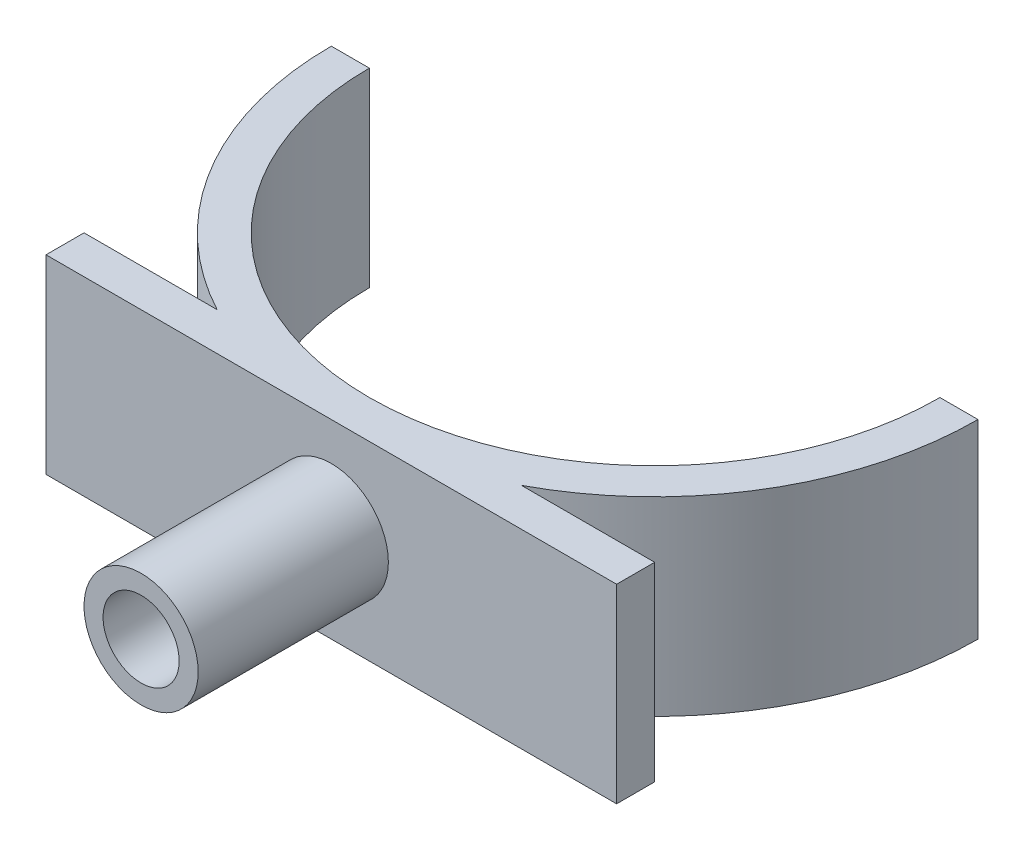
ISO-10303-21;
HEADER;
FILE_DESCRIPTION(('STEP AP214'),'2;1');
FILE_NAME('part.step','',(''),(''),'','','');
FILE_SCHEMA(('AUTOMOTIVE_DESIGN { 1 0 10303 214 1 1 1 1 }'));
ENDSEC;
DATA;
#1=APPLICATION_CONTEXT('core data for automotive mechanical design processes');
#2=APPLICATION_PROTOCOL_DEFINITION('international standard','automotive_design',2000,#1);
#3=PRODUCT_CONTEXT('',#1,'mechanical');
#4=PRODUCT('Part','Part','',(#3));
#5=PRODUCT_RELATED_PRODUCT_CATEGORY('part','',(#4));
#6=PRODUCT_DEFINITION_FORMATION('','',#4);
#7=PRODUCT_DEFINITION_CONTEXT('part definition',#1,'design');
#8=PRODUCT_DEFINITION('design','',#6,#7);
#9=PRODUCT_DEFINITION_SHAPE('','',#8);
#10=(LENGTH_UNIT() NAMED_UNIT(*) SI_UNIT(.MILLI.,.METRE.));
#11=(NAMED_UNIT(*) PLANE_ANGLE_UNIT() SI_UNIT($,.RADIAN.));
#12=(NAMED_UNIT(*) SI_UNIT($,.STERADIAN.) SOLID_ANGLE_UNIT());
#13=UNCERTAINTY_MEASURE_WITH_UNIT(LENGTH_MEASURE(1.E-05),#10,'distance_accuracy_value','');
#14=(GEOMETRIC_REPRESENTATION_CONTEXT(3) GLOBAL_UNCERTAINTY_ASSIGNED_CONTEXT((#13)) GLOBAL_UNIT_ASSIGNED_CONTEXT((#10,
#11,#12)) REPRESENTATION_CONTEXT('',''));
#15=CARTESIAN_POINT('',(0.,0.,0.));
#16=DIRECTION('',(0.,0.,1.));
#17=DIRECTION('',(1.,0.,0.));
#18=AXIS2_PLACEMENT_3D('',#15,#16,#17);
#19=CARTESIAN_POINT('',(0.,0.,-2.));
#20=DIRECTION('',(0.,0.,-1.));
#21=DIRECTION('',(-1.,0.,0.));
#22=AXIS2_PLACEMENT_3D('',#19,#20,#21);
#23=PLANE('',#22);
#24=DIRECTION('',(-1.,0.,0.));
#25=VECTOR('',#24,1.);
#26=CARTESIAN_POINT('',(15.,-5.,-2.));
#27=LINE('',#26,#25);
#28=CARTESIAN_POINT('',(15.,-5.,-2.));
#29=VERTEX_POINT('',#28);
#30=CARTESIAN_POINT('',(8.,-5.,-2.));
#31=VERTEX_POINT('',#30);
#32=EDGE_CURVE('E101',#29,#31,#27,.T.);
#33=ORIENTED_EDGE('',*,*,#32,.T.);
#34=DIRECTION('',(0.,-1.,0.));
#35=VECTOR('',#34,1.);
#36=CARTESIAN_POINT('',(8.,5.,-2.));
#37=LINE('',#36,#35);
#38=CARTESIAN_POINT('',(8.,5.,-2.));
#39=VERTEX_POINT('',#38);
#40=EDGE_CURVE('E105',#39,#31,#37,.T.);
#41=ORIENTED_EDGE('',*,*,#40,.F.);
#42=DIRECTION('',(1.,0.,0.));
#43=VECTOR('',#42,1.);
#44=CARTESIAN_POINT('',(0.,5.,-2.));
#45=LINE('',#44,#43);
#46=CARTESIAN_POINT('',(15.,5.,-2.));
#47=VERTEX_POINT('',#46);
#48=EDGE_CURVE('E215',#39,#47,#45,.T.);
#49=ORIENTED_EDGE('',*,*,#48,.T.);
#50=DIRECTION('',(0.,-1.,0.));
#51=VECTOR('',#50,1.);
#52=CARTESIAN_POINT('',(15.,5.,-2.));
#53=LINE('',#52,#51);
#54=EDGE_CURVE('E214',#47,#29,#53,.T.);
#55=ORIENTED_EDGE('',*,*,#54,.T.);
#56=EDGE_LOOP('',(#33,#41,#49,#55));
#57=FACE_BOUND('',#56,.T.);
#58=ADVANCED_FACE('F85',(#57),#23,.T.);
#59=CARTESIAN_POINT('',(0.,0.,10.));
#60=DIRECTION('',(0.,0.,1.));
#61=DIRECTION('',(1.,0.,0.));
#62=AXIS2_PLACEMENT_3D('',#59,#60,#61);
#63=PLANE('',#62);
#64=CARTESIAN_POINT('',(0.,0.,10.));
#65=DIRECTION('',(0.,0.,1.));
#66=DIRECTION('',(1.,0.,0.));
#67=AXIS2_PLACEMENT_3D('',#64,#65,#66);
#68=CIRCLE('',#67,3.);
#69=CARTESIAN_POINT('',(3.,0.,10.));
#70=VERTEX_POINT('',#69);
#71=EDGE_CURVE('E12',#70,#70,#68,.T.);
#72=ORIENTED_EDGE('',*,*,#71,.T.);
#73=EDGE_LOOP('',(#72));
#74=FACE_BOUND('',#73,.T.);
#75=CARTESIAN_POINT('',(0.,0.,10.));
#76=DIRECTION('',(0.,0.,1.));
#77=DIRECTION('',(1.,0.,0.));
#78=AXIS2_PLACEMENT_3D('',#75,#76,#77);
#79=CIRCLE('',#78,2.);
#80=CARTESIAN_POINT('',(2.,0.,10.));
#81=VERTEX_POINT('',#80);
#82=EDGE_CURVE('E94',#81,#81,#79,.T.);
#83=ORIENTED_EDGE('',*,*,#82,.F.);
#84=EDGE_LOOP('',(#83));
#85=FACE_BOUND('',#84,.T.);
#86=ADVANCED_FACE('F297',(#74,#85),#63,.T.);
#87=CARTESIAN_POINT('',(0.,0.,10.));
#88=DIRECTION('',(0.,0.,-1.));
#89=DIRECTION('',(-1.,0.,0.));
#90=AXIS2_PLACEMENT_3D('',#87,#88,#89);
#91=CYLINDRICAL_SURFACE('',#90,3.);
#92=ORIENTED_EDGE('',*,*,#71,.F.);
#93=EDGE_LOOP('',(#92));
#94=FACE_BOUND('',#93,.T.);
#95=CARTESIAN_POINT('',(0.,0.,0.));
#96=DIRECTION('',(0.,0.,1.));
#97=DIRECTION('',(1.,0.,0.));
#98=AXIS2_PLACEMENT_3D('',#95,#96,#97);
#99=CIRCLE('',#98,3.);
#100=CARTESIAN_POINT('',(3.,0.,0.));
#101=VERTEX_POINT('',#100);
#102=EDGE_CURVE('E89',#101,#101,#99,.T.);
#103=ORIENTED_EDGE('',*,*,#102,.T.);
#104=EDGE_LOOP('',(#103));
#105=FACE_BOUND('',#104,.T.);
#106=ADVANCED_FACE('F87',(#94,#105),#91,.T.);
#107=CARTESIAN_POINT('',(0.,0.,10.));
#108=DIRECTION('',(0.,0.,-1.));
#109=DIRECTION('',(-1.,0.,0.));
#110=AXIS2_PLACEMENT_3D('',#107,#108,#109);
#111=CYLINDRICAL_SURFACE('',#110,2.);
#112=ORIENTED_EDGE('',*,*,#82,.T.);
#113=EDGE_LOOP('',(#112));
#114=FACE_BOUND('',#113,.T.);
#115=CARTESIAN_POINT('',(0.,0.,0.));
#116=DIRECTION('',(0.,0.,1.));
#117=DIRECTION('',(1.,0.,0.));
#118=AXIS2_PLACEMENT_3D('',#115,#116,#117);
#119=CIRCLE('',#118,2.);
#120=CARTESIAN_POINT('',(2.,0.,0.));
#121=VERTEX_POINT('',#120);
#122=EDGE_CURVE('E243',#121,#121,#119,.T.);
#123=ORIENTED_EDGE('',*,*,#122,.F.);
#124=EDGE_LOOP('',(#123));
#125=FACE_BOUND('',#124,.T.);
#126=ADVANCED_FACE('F317',(#114,#125),#111,.F.);
#127=CARTESIAN_POINT('',(0.,0.,0.));
#128=DIRECTION('',(0.,0.,-1.));
#129=DIRECTION('',(-1.,0.,0.));
#130=AXIS2_PLACEMENT_3D('',#127,#128,#129);
#131=PLANE('',#130);
#132=ORIENTED_EDGE('',*,*,#122,.T.);
#133=EDGE_LOOP('',(#132));
#134=FACE_BOUND('',#133,.T.);
#135=ADVANCED_FACE('F257',(#134),#131,.F.);
#136=CARTESIAN_POINT('',(15.,5.,-2.));
#137=DIRECTION('',(-1.,0.,0.));
#138=DIRECTION('',(0.,0.,1.));
#139=AXIS2_PLACEMENT_3D('',#136,#137,#138);
#140=PLANE('',#139);
#141=DIRECTION('',(0.,-1.,0.));
#142=VECTOR('',#141,1.);
#143=CARTESIAN_POINT('',(15.,5.,0.));
#144=LINE('',#143,#142);
#145=CARTESIAN_POINT('',(15.,5.,0.));
#146=VERTEX_POINT('',#145);
#147=CARTESIAN_POINT('',(15.,-5.,0.));
#148=VERTEX_POINT('',#147);
#149=EDGE_CURVE('E207',#146,#148,#144,.T.);
#150=ORIENTED_EDGE('',*,*,#149,.T.);
#151=DIRECTION('',(0.,0.,1.));
#152=VECTOR('',#151,1.);
#153=CARTESIAN_POINT('',(15.,-5.,-2.));
#154=LINE('',#153,#152);
#155=EDGE_CURVE('E235',#29,#148,#154,.T.);
#156=ORIENTED_EDGE('',*,*,#155,.F.);
#157=ORIENTED_EDGE('',*,*,#54,.F.);
#158=DIRECTION('',(0.,0.,1.));
#159=VECTOR('',#158,1.);
#160=CARTESIAN_POINT('',(15.,5.,-2.));
#161=LINE('',#160,#159);
#162=EDGE_CURVE('E238',#47,#146,#161,.T.);
#163=ORIENTED_EDGE('',*,*,#162,.T.);
#164=EDGE_LOOP('',(#150,#156,#157,#163));
#165=FACE_BOUND('',#164,.T.);
#166=ADVANCED_FACE('F266',(#165),#140,.F.);
#167=CARTESIAN_POINT('',(15.,-5.,-2.));
#168=DIRECTION('',(0.,1.,0.));
#169=DIRECTION('',(0.,0.,1.));
#170=AXIS2_PLACEMENT_3D('',#167,#168,#169);
#171=PLANE('',#170);
#172=DIRECTION('',(-1.,0.,0.));
#173=VECTOR('',#172,1.);
#174=CARTESIAN_POINT('',(15.,-5.,0.));
#175=LINE('',#174,#173);
#176=CARTESIAN_POINT('',(-15.,-5.,0.));
#177=VERTEX_POINT('',#176);
#178=EDGE_CURVE('E224',#148,#177,#175,.T.);
#179=ORIENTED_EDGE('',*,*,#178,.T.);
#180=DIRECTION('',(0.,0.,1.));
#181=VECTOR('',#180,1.);
#182=CARTESIAN_POINT('',(-15.,-5.,-2.));
#183=LINE('',#182,#181);
#184=CARTESIAN_POINT('',(-15.,-5.,-2.));
#185=VERTEX_POINT('',#184);
#186=EDGE_CURVE('E232',#185,#177,#183,.T.);
#187=ORIENTED_EDGE('',*,*,#186,.F.);
#188=CARTESIAN_POINT('',(-8.,-5.,-2.));
#189=VERTEX_POINT('',#188);
#190=EDGE_CURVE('E217',#189,#185,#27,.T.);
#191=ORIENTED_EDGE('',*,*,#190,.F.);
#192=CARTESIAN_POINT('',(0.,-5.,-17.));
#193=DIRECTION('',(0.,1.,0.));
#194=DIRECTION('',(0.,0.,1.));
#195=AXIS2_PLACEMENT_3D('',#192,#193,#194);
#196=CIRCLE('',#195,17.);
#197=CARTESIAN_POINT('',(-17.,-5.,-16.9999999999999));
#198=VERTEX_POINT('',#197);
#199=EDGE_CURVE('E200',#198,#189,#196,.T.);
#200=ORIENTED_EDGE('',*,*,#199,.F.);
#201=DIRECTION('',(1.,0.,0.));
#202=VECTOR('',#201,1.);
#203=CARTESIAN_POINT('',(-1.00267016911465E-12,-5.,-17.0000000000009));
#204=LINE('',#203,#202);
#205=CARTESIAN_POINT('',(-15.,-5.,-17.));
#206=VERTEX_POINT('',#205);
#207=EDGE_CURVE('E198',#198,#206,#204,.T.);
#208=ORIENTED_EDGE('',*,*,#207,.T.);
#209=CARTESIAN_POINT('',(0.,-5.,-17.));
#210=DIRECTION('',(0.,1.,0.));
#211=DIRECTION('',(0.,0.,1.));
#212=AXIS2_PLACEMENT_3D('',#209,#210,#211);
#213=CIRCLE('',#212,15.);
#214=CARTESIAN_POINT('',(15.,-5.,-17.));
#215=VERTEX_POINT('',#214);
#216=EDGE_CURVE('E178',#206,#215,#213,.T.);
#217=ORIENTED_EDGE('',*,*,#216,.T.);
#218=DIRECTION('',(1.,0.,0.));
#219=VECTOR('',#218,1.);
#220=CARTESIAN_POINT('',(0.,-5.,-17.));
#221=LINE('',#220,#219);
#222=CARTESIAN_POINT('',(17.,-5.,-17.));
#223=VERTEX_POINT('',#222);
#224=EDGE_CURVE('E166',#215,#223,#221,.T.);
#225=ORIENTED_EDGE('',*,*,#224,.T.);
#226=CARTESIAN_POINT('',(0.,-5.,-17.));
#227=DIRECTION('',(0.,1.,0.));
#228=DIRECTION('',(0.,0.,1.));
#229=AXIS2_PLACEMENT_3D('',#226,#227,#228);
#230=CIRCLE('',#229,17.);
#231=EDGE_CURVE('E172',#31,#223,#230,.T.);
#232=ORIENTED_EDGE('',*,*,#231,.F.);
#233=ORIENTED_EDGE('',*,*,#32,.F.);
#234=ORIENTED_EDGE('',*,*,#155,.T.);
#235=EDGE_LOOP('',(#179,#187,#191,#200,#208,#217,#225,#232,#233,#234));
#236=FACE_BOUND('',#235,.T.);
#237=ADVANCED_FACE('F176',(#236),#171,.F.);
#238=CARTESIAN_POINT('',(-15.,-5.,-2.));
#239=DIRECTION('',(1.,0.,0.));
#240=DIRECTION('',(0.,0.,-1.));
#241=AXIS2_PLACEMENT_3D('',#238,#239,#240);
#242=PLANE('',#241);
#243=DIRECTION('',(0.,1.,0.));
#244=VECTOR('',#243,1.);
#245=CARTESIAN_POINT('',(-15.,-5.,0.));
#246=LINE('',#245,#244);
#247=CARTESIAN_POINT('',(-15.,5.,0.));
#248=VERTEX_POINT('',#247);
#249=EDGE_CURVE('E226',#177,#248,#246,.T.);
#250=ORIENTED_EDGE('',*,*,#249,.T.);
#251=DIRECTION('',(0.,0.,1.));
#252=VECTOR('',#251,1.);
#253=CARTESIAN_POINT('',(-15.,5.,-2.));
#254=LINE('',#253,#252);
#255=CARTESIAN_POINT('',(-15.,5.,-2.));
#256=VERTEX_POINT('',#255);
#257=EDGE_CURVE('E222',#256,#248,#254,.T.);
#258=ORIENTED_EDGE('',*,*,#257,.F.);
#259=DIRECTION('',(0.,1.,0.));
#260=VECTOR('',#259,1.);
#261=CARTESIAN_POINT('',(-15.,-5.,-2.));
#262=LINE('',#261,#260);
#263=EDGE_CURVE('E219',#185,#256,#262,.T.);
#264=ORIENTED_EDGE('',*,*,#263,.F.);
#265=ORIENTED_EDGE('',*,*,#186,.T.);
#266=EDGE_LOOP('',(#250,#258,#264,#265));
#267=FACE_BOUND('',#266,.T.);
#268=ADVANCED_FACE('F272',(#267),#242,.F.);
#269=CARTESIAN_POINT('',(0.,5.,-2.));
#270=DIRECTION('',(0.,-1.,0.));
#271=DIRECTION('',(0.,0.,-1.));
#272=AXIS2_PLACEMENT_3D('',#269,#270,#271);
#273=PLANE('',#272);
#274=DIRECTION('',(1.,0.,0.));
#275=VECTOR('',#274,1.);
#276=CARTESIAN_POINT('',(0.,5.,0.));
#277=LINE('',#276,#275);
#278=EDGE_CURVE('E228',#248,#146,#277,.T.);
#279=ORIENTED_EDGE('',*,*,#278,.T.);
#280=ORIENTED_EDGE('',*,*,#162,.F.);
#281=ORIENTED_EDGE('',*,*,#48,.F.);
#282=CARTESIAN_POINT('',(0.,5.,-17.));
#283=DIRECTION('',(0.,1.,0.));
#284=DIRECTION('',(0.,0.,1.));
#285=AXIS2_PLACEMENT_3D('',#282,#283,#284);
#286=CIRCLE('',#285,17.);
#287=CARTESIAN_POINT('',(17.,5.,-17.));
#288=VERTEX_POINT('',#287);
#289=EDGE_CURVE('E181',#39,#288,#286,.T.);
#290=ORIENTED_EDGE('',*,*,#289,.T.);
#291=DIRECTION('',(1.,0.,0.));
#292=VECTOR('',#291,1.);
#293=CARTESIAN_POINT('',(0.,5.,-17.));
#294=LINE('',#293,#292);
#295=CARTESIAN_POINT('',(15.,5.,-17.));
#296=VERTEX_POINT('',#295);
#297=EDGE_CURVE('E168',#296,#288,#294,.T.);
#298=ORIENTED_EDGE('',*,*,#297,.F.);
#299=CARTESIAN_POINT('',(0.,5.,-17.));
#300=DIRECTION('',(0.,1.,0.));
#301=DIRECTION('',(0.,0.,1.));
#302=AXIS2_PLACEMENT_3D('',#299,#300,#301);
#303=CIRCLE('',#302,15.);
#304=CARTESIAN_POINT('',(-15.,5.,-17.));
#305=VERTEX_POINT('',#304);
#306=EDGE_CURVE('E196',#305,#296,#303,.T.);
#307=ORIENTED_EDGE('',*,*,#306,.F.);
#308=DIRECTION('',(1.,0.,0.));
#309=VECTOR('',#308,1.);
#310=CARTESIAN_POINT('',(-1.00267016911465E-12,5.,-17.0000000000009));
#311=LINE('',#310,#309);
#312=CARTESIAN_POINT('',(-17.,5.,-16.9999999999999));
#313=VERTEX_POINT('',#312);
#314=EDGE_CURVE('E180',#313,#305,#311,.T.);
#315=ORIENTED_EDGE('',*,*,#314,.F.);
#316=CARTESIAN_POINT('',(0.,5.,-17.));
#317=DIRECTION('',(0.,1.,0.));
#318=DIRECTION('',(0.,0.,1.));
#319=AXIS2_PLACEMENT_3D('',#316,#317,#318);
#320=CIRCLE('',#319,17.);
#321=CARTESIAN_POINT('',(-8.,5.,-2.));
#322=VERTEX_POINT('',#321);
#323=EDGE_CURVE('E193',#313,#322,#320,.T.);
#324=ORIENTED_EDGE('',*,*,#323,.T.);
#325=EDGE_CURVE('E212',#256,#322,#45,.T.);
#326=ORIENTED_EDGE('',*,*,#325,.F.);
#327=ORIENTED_EDGE('',*,*,#257,.T.);
#328=EDGE_LOOP('',(#279,#280,#281,#290,#298,#307,#315,#324,#326,#327));
#329=FACE_BOUND('',#328,.T.);
#330=ADVANCED_FACE('F268',(#329),#273,.F.);
#331=DIRECTION('',(0.,1.,0.));
#332=VECTOR('',#331,1.);
#333=CARTESIAN_POINT('',(-8.,-5.,-2.));
#334=LINE('',#333,#332);
#335=EDGE_CURVE('E208',#189,#322,#334,.T.);
#336=ORIENTED_EDGE('',*,*,#335,.F.);
#337=ORIENTED_EDGE('',*,*,#190,.T.);
#338=ORIENTED_EDGE('',*,*,#263,.T.);
#339=ORIENTED_EDGE('',*,*,#325,.T.);
#340=EDGE_LOOP('',(#336,#337,#338,#339));
#341=FACE_BOUND('',#340,.T.);
#342=ADVANCED_FACE('F255',(#341),#23,.T.);
#343=ORIENTED_EDGE('',*,*,#102,.F.);
#344=EDGE_LOOP('',(#343));
#345=FACE_BOUND('',#344,.T.);
#346=ORIENTED_EDGE('',*,*,#149,.F.);
#347=ORIENTED_EDGE('',*,*,#278,.F.);
#348=ORIENTED_EDGE('',*,*,#249,.F.);
#349=ORIENTED_EDGE('',*,*,#178,.F.);
#350=EDGE_LOOP('',(#346,#347,#348,#349));
#351=FACE_BOUND('',#350,.T.);
#352=ADVANCED_FACE('F251',(#345,#351),#131,.F.);
#353=CARTESIAN_POINT('',(-1.00267016911465E-12,-5.,-17.0000000000009));
#354=DIRECTION('',(0.,0.,1.));
#355=DIRECTION('',(1.,0.,0.));
#356=AXIS2_PLACEMENT_3D('',#353,#354,#355);
#357=PLANE('',#356);
#358=ORIENTED_EDGE('',*,*,#314,.T.);
#359=DIRECTION('',(0.,1.,0.));
#360=VECTOR('',#359,1.);
#361=CARTESIAN_POINT('',(-15.,-5.,-17.));
#362=LINE('',#361,#360);
#363=EDGE_CURVE('E205',#206,#305,#362,.T.);
#364=ORIENTED_EDGE('',*,*,#363,.F.);
#365=ORIENTED_EDGE('',*,*,#207,.F.);
#366=DIRECTION('',(0.,1.,0.));
#367=VECTOR('',#366,1.);
#368=CARTESIAN_POINT('',(-17.,-5.,-16.9999999999999));
#369=LINE('',#368,#367);
#370=EDGE_CURVE('E204',#198,#313,#369,.T.);
#371=ORIENTED_EDGE('',*,*,#370,.T.);
#372=EDGE_LOOP('',(#358,#364,#365,#371));
#373=FACE_BOUND('',#372,.T.);
#374=ADVANCED_FACE('F254',(#373),#357,.F.);
#375=CARTESIAN_POINT('',(0.,-5.,-17.));
#376=DIRECTION('',(0.,1.,0.));
#377=DIRECTION('',(0.,0.,1.));
#378=AXIS2_PLACEMENT_3D('',#375,#376,#377);
#379=CYLINDRICAL_SURFACE('',#378,15.);
#380=ORIENTED_EDGE('',*,*,#306,.T.);
#381=DIRECTION('',(0.,-1.,0.));
#382=VECTOR('',#381,1.);
#383=CARTESIAN_POINT('',(15.,5.,-17.));
#384=LINE('',#383,#382);
#385=EDGE_CURVE('E188',#296,#215,#384,.T.);
#386=ORIENTED_EDGE('',*,*,#385,.T.);
#387=ORIENTED_EDGE('',*,*,#216,.F.);
#388=ORIENTED_EDGE('',*,*,#363,.T.);
#389=EDGE_LOOP('',(#380,#386,#387,#388));
#390=FACE_BOUND('',#389,.T.);
#391=ADVANCED_FACE('F286',(#390),#379,.F.);
#392=CARTESIAN_POINT('',(0.,-5.,-17.));
#393=DIRECTION('',(0.,1.,0.));
#394=DIRECTION('',(0.,0.,1.));
#395=AXIS2_PLACEMENT_3D('',#392,#393,#394);
#396=CYLINDRICAL_SURFACE('',#395,17.);
#397=ORIENTED_EDGE('',*,*,#323,.F.);
#398=ORIENTED_EDGE('',*,*,#370,.F.);
#399=ORIENTED_EDGE('',*,*,#199,.T.);
#400=ORIENTED_EDGE('',*,*,#335,.T.);
#401=EDGE_LOOP('',(#397,#398,#399,#400));
#402=FACE_BOUND('',#401,.T.);
#403=ADVANCED_FACE('F279',(#402),#396,.T.);
#404=CARTESIAN_POINT('',(0.,5.,-17.));
#405=DIRECTION('',(0.,-1.,0.));
#406=DIRECTION('',(0.,0.,-1.));
#407=AXIS2_PLACEMENT_3D('',#404,#405,#406);
#408=CYLINDRICAL_SURFACE('',#407,17.);
#409=ORIENTED_EDGE('',*,*,#40,.T.);
#410=ORIENTED_EDGE('',*,*,#231,.T.);
#411=DIRECTION('',(0.,-1.,0.));
#412=VECTOR('',#411,1.);
#413=CARTESIAN_POINT('',(17.,5.,-17.));
#414=LINE('',#413,#412);
#415=EDGE_CURVE('E162',#288,#223,#414,.T.);
#416=ORIENTED_EDGE('',*,*,#415,.F.);
#417=ORIENTED_EDGE('',*,*,#289,.F.);
#418=EDGE_LOOP('',(#409,#410,#416,#417));
#419=FACE_BOUND('',#418,.T.);
#420=ADVANCED_FACE('F183',(#419),#408,.T.);
#421=CARTESIAN_POINT('',(0.,5.,-17.));
#422=DIRECTION('',(0.,0.,-1.));
#423=DIRECTION('',(-1.,0.,0.));
#424=AXIS2_PLACEMENT_3D('',#421,#422,#423);
#425=PLANE('',#424);
#426=ORIENTED_EDGE('',*,*,#415,.T.);
#427=ORIENTED_EDGE('',*,*,#224,.F.);
#428=ORIENTED_EDGE('',*,*,#385,.F.);
#429=ORIENTED_EDGE('',*,*,#297,.T.);
#430=EDGE_LOOP('',(#426,#427,#428,#429));
#431=FACE_BOUND('',#430,.T.);
#432=ADVANCED_FACE('F164',(#431),#425,.T.);
#433=CLOSED_SHELL('',(#58,#86,#106,#126,#135,#166,#237,#268,#330,#342,#352,#374,#391,#403,#420,#432));
#434=MANIFOLD_SOLID_BREP('B2',#433);
#435=ADVANCED_BREP_SHAPE_REPRESENTATION('',(#18,#434),#14);
#436=SHAPE_DEFINITION_REPRESENTATION(#9,#435);
ENDSEC;
END-ISO-10303-21;
